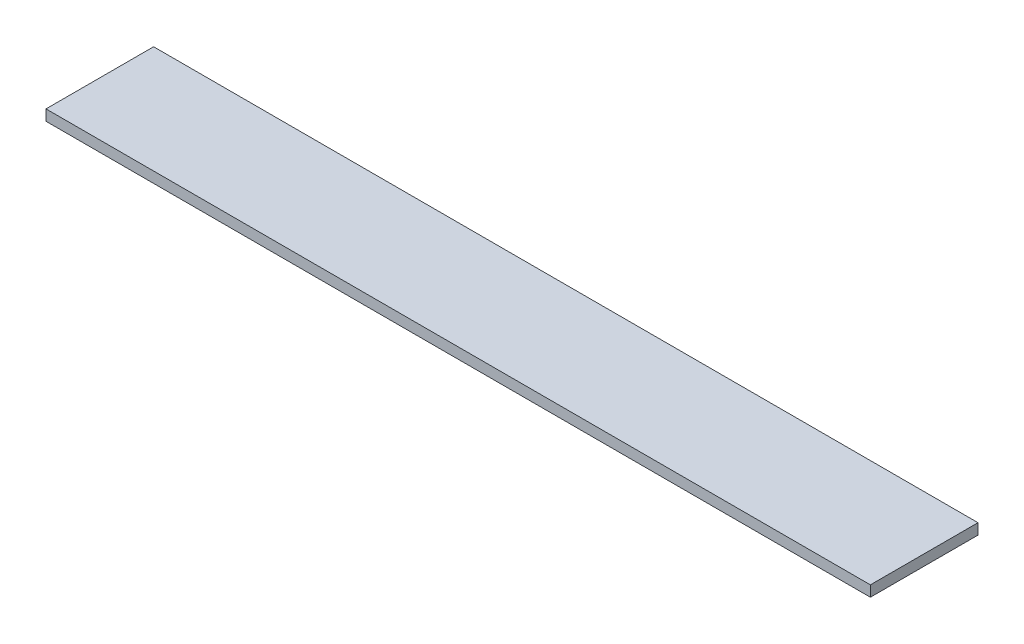
ISO-10303-21;
HEADER;
FILE_DESCRIPTION(('STEP AP214'),'2;1');
FILE_NAME('part.step','',(''),(''),'','','');
FILE_SCHEMA(('AUTOMOTIVE_DESIGN { 1 0 10303 214 1 1 1 1 }'));
ENDSEC;
DATA;
#1=APPLICATION_CONTEXT('core data for automotive mechanical design processes');
#2=APPLICATION_PROTOCOL_DEFINITION('international standard','automotive_design',2000,#1);
#3=PRODUCT_CONTEXT('',#1,'mechanical');
#4=PRODUCT('Part','Part','',(#3));
#5=PRODUCT_RELATED_PRODUCT_CATEGORY('part','',(#4));
#6=PRODUCT_DEFINITION_FORMATION('','',#4);
#7=PRODUCT_DEFINITION_CONTEXT('part definition',#1,'design');
#8=PRODUCT_DEFINITION('design','',#6,#7);
#9=PRODUCT_DEFINITION_SHAPE('','',#8);
#10=(LENGTH_UNIT() NAMED_UNIT(*) SI_UNIT(.MILLI.,.METRE.));
#11=(NAMED_UNIT(*) PLANE_ANGLE_UNIT() SI_UNIT($,.RADIAN.));
#12=(NAMED_UNIT(*) SI_UNIT($,.STERADIAN.) SOLID_ANGLE_UNIT());
#13=UNCERTAINTY_MEASURE_WITH_UNIT(LENGTH_MEASURE(1.E-05),#10,'distance_accuracy_value','');
#14=(GEOMETRIC_REPRESENTATION_CONTEXT(3) GLOBAL_UNCERTAINTY_ASSIGNED_CONTEXT((#13)) GLOBAL_UNIT_ASSIGNED_CONTEXT((#10,
#11,#12)) REPRESENTATION_CONTEXT('',''));
#15=CARTESIAN_POINT('',(0.,0.,0.));
#16=DIRECTION('',(0.,0.,1.));
#17=DIRECTION('',(1.,0.,0.));
#18=AXIS2_PLACEMENT_3D('',#15,#16,#17);
#19=CARTESIAN_POINT('',(0.,10.,0.));
#20=DIRECTION('',(1.,0.,0.));
#21=DIRECTION('',(0.,0.,-1.));
#22=AXIS2_PLACEMENT_3D('',#19,#20,#21);
#23=PLANE('',#22);
#24=DIRECTION('',(0.,0.,1.));
#25=VECTOR('',#24,1.);
#26=CARTESIAN_POINT('',(0.,0.,0.));
#27=LINE('',#26,#25);
#28=CARTESIAN_POINT('',(0.,0.,-100.));
#29=VERTEX_POINT('',#28);
#30=CARTESIAN_POINT('',(0.,0.,0.));
#31=VERTEX_POINT('',#30);
#32=EDGE_CURVE('E94',#29,#31,#27,.T.);
#33=ORIENTED_EDGE('',*,*,#32,.T.);
#34=DIRECTION('',(0.,-1.,0.));
#35=VECTOR('',#34,1.);
#36=CARTESIAN_POINT('',(0.,10.,0.));
#37=LINE('',#36,#35);
#38=CARTESIAN_POINT('',(0.,10.,0.));
#39=VERTEX_POINT('',#38);
#40=EDGE_CURVE('E11',#39,#31,#37,.T.);
#41=ORIENTED_EDGE('',*,*,#40,.F.);
#42=DIRECTION('',(0.,0.,1.));
#43=VECTOR('',#42,1.);
#44=CARTESIAN_POINT('',(0.,10.,0.));
#45=LINE('',#44,#43);
#46=CARTESIAN_POINT('',(0.,10.,-100.));
#47=VERTEX_POINT('',#46);
#48=EDGE_CURVE('E82',#47,#39,#45,.T.);
#49=ORIENTED_EDGE('',*,*,#48,.F.);
#50=DIRECTION('',(0.,-1.,0.));
#51=VECTOR('',#50,1.);
#52=CARTESIAN_POINT('',(0.,10.,-100.));
#53=LINE('',#52,#51);
#54=EDGE_CURVE('E90',#47,#29,#53,.T.);
#55=ORIENTED_EDGE('',*,*,#54,.T.);
#56=EDGE_LOOP('',(#33,#41,#49,#55));
#57=FACE_BOUND('',#56,.T.);
#58=ADVANCED_FACE('F31',(#57),#23,.F.);
#59=CARTESIAN_POINT('',(0.,10.,0.));
#60=DIRECTION('',(0.,0.,-1.));
#61=DIRECTION('',(-1.,0.,0.));
#62=AXIS2_PLACEMENT_3D('',#59,#60,#61);
#63=PLANE('',#62);
#64=DIRECTION('',(1.,0.,0.));
#65=VECTOR('',#64,1.);
#66=CARTESIAN_POINT('',(0.,0.,0.));
#67=LINE('',#66,#65);
#68=CARTESIAN_POINT('',(766.,0.,0.));
#69=VERTEX_POINT('',#68);
#70=EDGE_CURVE('E86',#31,#69,#67,.T.);
#71=ORIENTED_EDGE('',*,*,#70,.T.);
#72=DIRECTION('',(0.,-1.,0.));
#73=VECTOR('',#72,1.);
#74=CARTESIAN_POINT('',(766.,10.,0.));
#75=LINE('',#74,#73);
#76=CARTESIAN_POINT('',(766.,10.,0.));
#77=VERTEX_POINT('',#76);
#78=EDGE_CURVE('E39',#77,#69,#75,.T.);
#79=ORIENTED_EDGE('',*,*,#78,.F.);
#80=DIRECTION('',(1.,0.,0.));
#81=VECTOR('',#80,1.);
#82=CARTESIAN_POINT('',(0.,10.,0.));
#83=LINE('',#82,#81);
#84=EDGE_CURVE('E77',#39,#77,#83,.T.);
#85=ORIENTED_EDGE('',*,*,#84,.F.);
#86=ORIENTED_EDGE('',*,*,#40,.T.);
#87=EDGE_LOOP('',(#71,#79,#85,#86));
#88=FACE_BOUND('',#87,.T.);
#89=ADVANCED_FACE('F85',(#88),#63,.F.);
#90=CARTESIAN_POINT('',(766.,10.,0.));
#91=DIRECTION('',(-1.,0.,0.));
#92=DIRECTION('',(0.,0.,1.));
#93=AXIS2_PLACEMENT_3D('',#90,#91,#92);
#94=PLANE('',#93);
#95=DIRECTION('',(0.,0.,-1.));
#96=VECTOR('',#95,1.);
#97=CARTESIAN_POINT('',(766.,0.,0.));
#98=LINE('',#97,#96);
#99=CARTESIAN_POINT('',(766.,0.,-100.));
#100=VERTEX_POINT('',#99);
#101=EDGE_CURVE('E64',#69,#100,#98,.T.);
#102=ORIENTED_EDGE('',*,*,#101,.T.);
#103=DIRECTION('',(0.,-1.,0.));
#104=VECTOR('',#103,1.);
#105=CARTESIAN_POINT('',(766.,10.,-100.));
#106=LINE('',#105,#104);
#107=CARTESIAN_POINT('',(766.,10.,-100.));
#108=VERTEX_POINT('',#107);
#109=EDGE_CURVE('E87',#108,#100,#106,.T.);
#110=ORIENTED_EDGE('',*,*,#109,.F.);
#111=DIRECTION('',(0.,0.,-1.));
#112=VECTOR('',#111,1.);
#113=CARTESIAN_POINT('',(766.,10.,0.));
#114=LINE('',#113,#112);
#115=EDGE_CURVE('E80',#77,#108,#114,.T.);
#116=ORIENTED_EDGE('',*,*,#115,.F.);
#117=ORIENTED_EDGE('',*,*,#78,.T.);
#118=EDGE_LOOP('',(#102,#110,#116,#117));
#119=FACE_BOUND('',#118,.T.);
#120=ADVANCED_FACE('F88',(#119),#94,.F.);
#121=CARTESIAN_POINT('',(0.,10.,-100.));
#122=DIRECTION('',(0.,0.,1.));
#123=DIRECTION('',(1.,0.,0.));
#124=AXIS2_PLACEMENT_3D('',#121,#122,#123);
#125=PLANE('',#124);
#126=DIRECTION('',(-1.,0.,0.));
#127=VECTOR('',#126,1.);
#128=CARTESIAN_POINT('',(0.,0.,-100.));
#129=LINE('',#128,#127);
#130=EDGE_CURVE('E70',#100,#29,#129,.T.);
#131=ORIENTED_EDGE('',*,*,#130,.T.);
#132=ORIENTED_EDGE('',*,*,#54,.F.);
#133=DIRECTION('',(-1.,0.,0.));
#134=VECTOR('',#133,1.);
#135=CARTESIAN_POINT('',(0.,10.,-100.));
#136=LINE('',#135,#134);
#137=EDGE_CURVE('E47',#108,#47,#136,.T.);
#138=ORIENTED_EDGE('',*,*,#137,.F.);
#139=ORIENTED_EDGE('',*,*,#109,.T.);
#140=EDGE_LOOP('',(#131,#132,#138,#139));
#141=FACE_BOUND('',#140,.T.);
#142=ADVANCED_FACE('F101',(#141),#125,.F.);
#143=CARTESIAN_POINT('',(0.,10.,-100.));
#144=DIRECTION('',(0.,-1.,0.));
#145=DIRECTION('',(0.,0.,-1.));
#146=AXIS2_PLACEMENT_3D('',#143,#144,#145);
#147=PLANE('',#146);
#148=ORIENTED_EDGE('',*,*,#48,.T.);
#149=ORIENTED_EDGE('',*,*,#84,.T.);
#150=ORIENTED_EDGE('',*,*,#115,.T.);
#151=ORIENTED_EDGE('',*,*,#137,.T.);
#152=EDGE_LOOP('',(#148,#149,#150,#151));
#153=FACE_BOUND('',#152,.T.);
#154=ADVANCED_FACE('F78',(#153),#147,.F.);
#155=CARTESIAN_POINT('',(0.,0.,-100.));
#156=DIRECTION('',(0.,-1.,0.));
#157=DIRECTION('',(0.,0.,-1.));
#158=AXIS2_PLACEMENT_3D('',#155,#156,#157);
#159=PLANE('',#158);
#160=ORIENTED_EDGE('',*,*,#32,.F.);
#161=ORIENTED_EDGE('',*,*,#130,.F.);
#162=ORIENTED_EDGE('',*,*,#101,.F.);
#163=ORIENTED_EDGE('',*,*,#70,.F.);
#164=EDGE_LOOP('',(#160,#161,#162,#163));
#165=FACE_BOUND('',#164,.T.);
#166=ADVANCED_FACE('F104',(#165),#159,.T.);
#167=CLOSED_SHELL('',(#58,#89,#120,#142,#154,#166));
#168=MANIFOLD_SOLID_BREP('B2',#167);
#169=ADVANCED_BREP_SHAPE_REPRESENTATION('',(#18,#168),#14);
#170=SHAPE_DEFINITION_REPRESENTATION(#9,#169);
ENDSEC;
END-ISO-10303-21;
